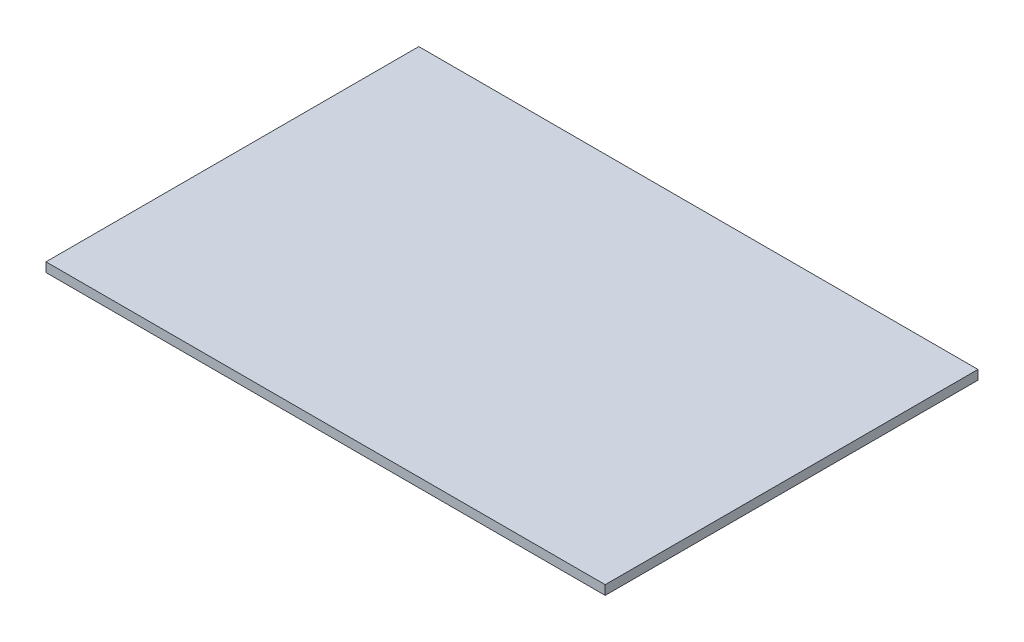
ISO-10303-21;
HEADER;
FILE_DESCRIPTION(('STEP AP214'),'2;1');
FILE_NAME('part.step','',(''),(''),'','','');
FILE_SCHEMA(('AUTOMOTIVE_DESIGN { 1 0 10303 214 1 1 1 1 }'));
ENDSEC;
DATA;
#1=APPLICATION_CONTEXT('core data for automotive mechanical design processes');
#2=APPLICATION_PROTOCOL_DEFINITION('international standard','automotive_design',2000,#1);
#3=PRODUCT_CONTEXT('',#1,'mechanical');
#4=PRODUCT('Part','Part','',(#3));
#5=PRODUCT_RELATED_PRODUCT_CATEGORY('part','',(#4));
#6=PRODUCT_DEFINITION_FORMATION('','',#4);
#7=PRODUCT_DEFINITION_CONTEXT('part definition',#1,'design');
#8=PRODUCT_DEFINITION('design','',#6,#7);
#9=PRODUCT_DEFINITION_SHAPE('','',#8);
#10=(LENGTH_UNIT() NAMED_UNIT(*) SI_UNIT(.MILLI.,.METRE.));
#11=(NAMED_UNIT(*) PLANE_ANGLE_UNIT() SI_UNIT($,.RADIAN.));
#12=(NAMED_UNIT(*) SI_UNIT($,.STERADIAN.) SOLID_ANGLE_UNIT());
#13=UNCERTAINTY_MEASURE_WITH_UNIT(LENGTH_MEASURE(1.E-05),#10,'distance_accuracy_value','');
#14=(GEOMETRIC_REPRESENTATION_CONTEXT(3) GLOBAL_UNCERTAINTY_ASSIGNED_CONTEXT((#13)) GLOBAL_UNIT_ASSIGNED_CONTEXT((#10,
#11,#12)) REPRESENTATION_CONTEXT('',''));
#15=CARTESIAN_POINT('',(0.,0.,0.));
#16=DIRECTION('',(0.,0.,1.));
#17=DIRECTION('',(1.,0.,0.));
#18=AXIS2_PLACEMENT_3D('',#15,#16,#17);
#19=CARTESIAN_POINT('',(300.,-10.,200.));
#20=DIRECTION('',(1.,0.,0.));
#21=DIRECTION('',(0.,0.,-1.));
#22=AXIS2_PLACEMENT_3D('',#19,#20,#21);
#23=PLANE('',#22);
#24=DIRECTION('',(0.,0.,-1.));
#25=VECTOR('',#24,1.);
#26=CARTESIAN_POINT('',(300.,0.,200.));
#27=LINE('',#26,#25);
#28=CARTESIAN_POINT('',(300.,0.,200.));
#29=VERTEX_POINT('',#28);
#30=CARTESIAN_POINT('',(300.,0.,-200.));
#31=VERTEX_POINT('',#30);
#32=EDGE_CURVE('E112',#29,#31,#27,.T.);
#33=ORIENTED_EDGE('',*,*,#32,.F.);
#34=DIRECTION('',(0.,1.,0.));
#35=VECTOR('',#34,1.);
#36=CARTESIAN_POINT('',(300.,-10.,200.));
#37=LINE('',#36,#35);
#38=CARTESIAN_POINT('',(300.,-10.,200.));
#39=VERTEX_POINT('',#38);
#40=EDGE_CURVE('E12',#39,#29,#37,.T.);
#41=ORIENTED_EDGE('',*,*,#40,.F.);
#42=DIRECTION('',(0.,0.,-1.));
#43=VECTOR('',#42,1.);
#44=CARTESIAN_POINT('',(300.,-10.,200.));
#45=LINE('',#44,#43);
#46=CARTESIAN_POINT('',(300.,-10.,-200.));
#47=VERTEX_POINT('',#46);
#48=EDGE_CURVE('E107',#39,#47,#45,.T.);
#49=ORIENTED_EDGE('',*,*,#48,.T.);
#50=DIRECTION('',(0.,1.,0.));
#51=VECTOR('',#50,1.);
#52=CARTESIAN_POINT('',(300.,-10.,-200.));
#53=LINE('',#52,#51);
#54=EDGE_CURVE('E50',#47,#31,#53,.T.);
#55=ORIENTED_EDGE('',*,*,#54,.T.);
#56=EDGE_LOOP('',(#33,#41,#49,#55));
#57=FACE_BOUND('',#56,.T.);
#58=ADVANCED_FACE('F47',(#57),#23,.T.);
#59=CARTESIAN_POINT('',(300.,-10.,200.));
#60=DIRECTION('',(0.,0.,-1.));
#61=DIRECTION('',(-1.,0.,0.));
#62=AXIS2_PLACEMENT_3D('',#59,#60,#61);
#63=PLANE('',#62);
#64=DIRECTION('',(-1.,0.,0.));
#65=VECTOR('',#64,1.);
#66=CARTESIAN_POINT('',(300.,0.,200.));
#67=LINE('',#66,#65);
#68=CARTESIAN_POINT('',(-300.,0.,200.));
#69=VERTEX_POINT('',#68);
#70=EDGE_CURVE('E80',#29,#69,#67,.T.);
#71=ORIENTED_EDGE('',*,*,#70,.T.);
#72=DIRECTION('',(0.,1.,0.));
#73=VECTOR('',#72,1.);
#74=CARTESIAN_POINT('',(-300.,-10.,200.));
#75=LINE('',#74,#73);
#76=CARTESIAN_POINT('',(-300.,-10.,200.));
#77=VERTEX_POINT('',#76);
#78=EDGE_CURVE('E56',#77,#69,#75,.T.);
#79=ORIENTED_EDGE('',*,*,#78,.F.);
#80=DIRECTION('',(-1.,0.,0.));
#81=VECTOR('',#80,1.);
#82=CARTESIAN_POINT('',(300.,-10.,200.));
#83=LINE('',#82,#81);
#84=EDGE_CURVE('E97',#39,#77,#83,.T.);
#85=ORIENTED_EDGE('',*,*,#84,.F.);
#86=ORIENTED_EDGE('',*,*,#40,.T.);
#87=EDGE_LOOP('',(#71,#79,#85,#86));
#88=FACE_BOUND('',#87,.T.);
#89=ADVANCED_FACE('F122',(#88),#63,.F.);
#90=CARTESIAN_POINT('',(-300.,-10.,200.));
#91=DIRECTION('',(1.,0.,0.));
#92=DIRECTION('',(0.,0.,-1.));
#93=AXIS2_PLACEMENT_3D('',#90,#91,#92);
#94=PLANE('',#93);
#95=DIRECTION('',(0.,0.,-1.));
#96=VECTOR('',#95,1.);
#97=CARTESIAN_POINT('',(-300.,0.,200.));
#98=LINE('',#97,#96);
#99=CARTESIAN_POINT('',(-300.,0.,-200.));
#100=VERTEX_POINT('',#99);
#101=EDGE_CURVE('E104',#69,#100,#98,.T.);
#102=ORIENTED_EDGE('',*,*,#101,.T.);
#103=DIRECTION('',(0.,1.,0.));
#104=VECTOR('',#103,1.);
#105=CARTESIAN_POINT('',(-300.,-10.,-200.));
#106=LINE('',#105,#104);
#107=CARTESIAN_POINT('',(-300.,-10.,-200.));
#108=VERTEX_POINT('',#107);
#109=EDGE_CURVE('E101',#108,#100,#106,.T.);
#110=ORIENTED_EDGE('',*,*,#109,.F.);
#111=DIRECTION('',(0.,0.,-1.));
#112=VECTOR('',#111,1.);
#113=CARTESIAN_POINT('',(-300.,-10.,200.));
#114=LINE('',#113,#112);
#115=EDGE_CURVE('E92',#77,#108,#114,.T.);
#116=ORIENTED_EDGE('',*,*,#115,.F.);
#117=ORIENTED_EDGE('',*,*,#78,.T.);
#118=EDGE_LOOP('',(#102,#110,#116,#117));
#119=FACE_BOUND('',#118,.T.);
#120=ADVANCED_FACE('F102',(#119),#94,.F.);
#121=CARTESIAN_POINT('',(300.,-10.,-200.));
#122=DIRECTION('',(0.,0.,-1.));
#123=DIRECTION('',(-1.,0.,0.));
#124=AXIS2_PLACEMENT_3D('',#121,#122,#123);
#125=PLANE('',#124);
#126=DIRECTION('',(-1.,0.,0.));
#127=VECTOR('',#126,1.);
#128=CARTESIAN_POINT('',(300.,0.,-200.));
#129=LINE('',#128,#127);
#130=EDGE_CURVE('E115',#31,#100,#129,.T.);
#131=ORIENTED_EDGE('',*,*,#130,.F.);
#132=ORIENTED_EDGE('',*,*,#54,.F.);
#133=DIRECTION('',(-1.,0.,0.));
#134=VECTOR('',#133,1.);
#135=CARTESIAN_POINT('',(300.,-10.,-200.));
#136=LINE('',#135,#134);
#137=EDGE_CURVE('E96',#47,#108,#136,.T.);
#138=ORIENTED_EDGE('',*,*,#137,.T.);
#139=ORIENTED_EDGE('',*,*,#109,.T.);
#140=EDGE_LOOP('',(#131,#132,#138,#139));
#141=FACE_BOUND('',#140,.T.);
#142=ADVANCED_FACE('F106',(#141),#125,.T.);
#143=CARTESIAN_POINT('',(0.,-10.,0.));
#144=DIRECTION('',(0.,1.,0.));
#145=DIRECTION('',(0.,0.,1.));
#146=AXIS2_PLACEMENT_3D('',#143,#144,#145);
#147=PLANE('',#146);
#148=ORIENTED_EDGE('',*,*,#48,.F.);
#149=ORIENTED_EDGE('',*,*,#84,.T.);
#150=ORIENTED_EDGE('',*,*,#115,.T.);
#151=ORIENTED_EDGE('',*,*,#137,.F.);
#152=EDGE_LOOP('',(#148,#149,#150,#151));
#153=FACE_BOUND('',#152,.T.);
#154=ADVANCED_FACE('F95',(#153),#147,.F.);
#155=CARTESIAN_POINT('',(0.,0.,0.));
#156=DIRECTION('',(0.,1.,0.));
#157=DIRECTION('',(0.,0.,1.));
#158=AXIS2_PLACEMENT_3D('',#155,#156,#157);
#159=PLANE('',#158);
#160=ORIENTED_EDGE('',*,*,#32,.T.);
#161=ORIENTED_EDGE('',*,*,#130,.T.);
#162=ORIENTED_EDGE('',*,*,#101,.F.);
#163=ORIENTED_EDGE('',*,*,#70,.F.);
#164=EDGE_LOOP('',(#160,#161,#162,#163));
#165=FACE_BOUND('',#164,.T.);
#166=ADVANCED_FACE('F120',(#165),#159,.T.);
#167=CLOSED_SHELL('',(#58,#89,#120,#142,#154,#166));
#168=MANIFOLD_SOLID_BREP('B2',#167);
#169=CARTESIAN_POINT('',(300.,-10.,200.));
#170=DIRECTION('',(1.,0.,0.));
#171=DIRECTION('',(0.,0.,-1.));
#172=AXIS2_PLACEMENT_3D('',#169,#170,#171);
#173=PLANE('',#172);
#174=DIRECTION('',(0.,0.,-1.));
#175=VECTOR('',#174,1.);
#176=CARTESIAN_POINT('',(300.,0.,200.));
#177=LINE('',#176,#175);
#178=CARTESIAN_POINT('',(300.,0.,200.));
#179=VERTEX_POINT('',#178);
#180=CARTESIAN_POINT('',(300.,0.,-200.));
#181=VERTEX_POINT('',#180);
#182=EDGE_CURVE('E249',#179,#181,#177,.T.);
#183=ORIENTED_EDGE('',*,*,#182,.F.);
#184=DIRECTION('',(0.,1.,0.));
#185=VECTOR('',#184,1.);
#186=CARTESIAN_POINT('',(300.,-10.,200.));
#187=LINE('',#186,#185);
#188=CARTESIAN_POINT('',(300.,-10.,200.));
#189=VERTEX_POINT('',#188);
#190=EDGE_CURVE('E45',#189,#179,#187,.T.);
#191=ORIENTED_EDGE('',*,*,#190,.F.);
#192=DIRECTION('',(0.,0.,-1.));
#193=VECTOR('',#192,1.);
#194=CARTESIAN_POINT('',(300.,-10.,200.));
#195=LINE('',#194,#193);
#196=CARTESIAN_POINT('',(300.,-10.,-200.));
#197=VERTEX_POINT('',#196);
#198=EDGE_CURVE('E244',#189,#197,#195,.T.);
#199=ORIENTED_EDGE('',*,*,#198,.T.);
#200=DIRECTION('',(0.,1.,0.));
#201=VECTOR('',#200,1.);
#202=CARTESIAN_POINT('',(300.,-10.,-200.));
#203=LINE('',#202,#201);
#204=EDGE_CURVE('E187',#197,#181,#203,.T.);
#205=ORIENTED_EDGE('',*,*,#204,.T.);
#206=EDGE_LOOP('',(#183,#191,#199,#205));
#207=FACE_BOUND('',#206,.T.);
#208=ADVANCED_FACE('F184',(#207),#173,.T.);
#209=CARTESIAN_POINT('',(300.,-10.,200.));
#210=DIRECTION('',(0.,0.,-1.));
#211=DIRECTION('',(-1.,0.,0.));
#212=AXIS2_PLACEMENT_3D('',#209,#210,#211);
#213=PLANE('',#212);
#214=DIRECTION('',(-1.,0.,0.));
#215=VECTOR('',#214,1.);
#216=CARTESIAN_POINT('',(300.,0.,200.));
#217=LINE('',#216,#215);
#218=CARTESIAN_POINT('',(-300.,0.,200.));
#219=VERTEX_POINT('',#218);
#220=EDGE_CURVE('E217',#179,#219,#217,.T.);
#221=ORIENTED_EDGE('',*,*,#220,.T.);
#222=DIRECTION('',(0.,1.,0.));
#223=VECTOR('',#222,1.);
#224=CARTESIAN_POINT('',(-300.,-10.,200.));
#225=LINE('',#224,#223);
#226=CARTESIAN_POINT('',(-300.,-10.,200.));
#227=VERTEX_POINT('',#226);
#228=EDGE_CURVE('E193',#227,#219,#225,.T.);
#229=ORIENTED_EDGE('',*,*,#228,.F.);
#230=DIRECTION('',(-1.,0.,0.));
#231=VECTOR('',#230,1.);
#232=CARTESIAN_POINT('',(300.,-10.,200.));
#233=LINE('',#232,#231);
#234=EDGE_CURVE('E234',#189,#227,#233,.T.);
#235=ORIENTED_EDGE('',*,*,#234,.F.);
#236=ORIENTED_EDGE('',*,*,#190,.T.);
#237=EDGE_LOOP('',(#221,#229,#235,#236));
#238=FACE_BOUND('',#237,.T.);
#239=ADVANCED_FACE('F259',(#238),#213,.F.);
#240=CARTESIAN_POINT('',(-300.,-10.,200.));
#241=DIRECTION('',(1.,0.,0.));
#242=DIRECTION('',(0.,0.,-1.));
#243=AXIS2_PLACEMENT_3D('',#240,#241,#242);
#244=PLANE('',#243);
#245=DIRECTION('',(0.,0.,-1.));
#246=VECTOR('',#245,1.);
#247=CARTESIAN_POINT('',(-300.,0.,200.));
#248=LINE('',#247,#246);
#249=CARTESIAN_POINT('',(-300.,0.,-200.));
#250=VERTEX_POINT('',#249);
#251=EDGE_CURVE('E241',#219,#250,#248,.T.);
#252=ORIENTED_EDGE('',*,*,#251,.T.);
#253=DIRECTION('',(0.,1.,0.));
#254=VECTOR('',#253,1.);
#255=CARTESIAN_POINT('',(-300.,-10.,-200.));
#256=LINE('',#255,#254);
#257=CARTESIAN_POINT('',(-300.,-10.,-200.));
#258=VERTEX_POINT('',#257);
#259=EDGE_CURVE('E238',#258,#250,#256,.T.);
#260=ORIENTED_EDGE('',*,*,#259,.F.);
#261=DIRECTION('',(0.,0.,-1.));
#262=VECTOR('',#261,1.);
#263=CARTESIAN_POINT('',(-300.,-10.,200.));
#264=LINE('',#263,#262);
#265=EDGE_CURVE('E229',#227,#258,#264,.T.);
#266=ORIENTED_EDGE('',*,*,#265,.F.);
#267=ORIENTED_EDGE('',*,*,#228,.T.);
#268=EDGE_LOOP('',(#252,#260,#266,#267));
#269=FACE_BOUND('',#268,.T.);
#270=ADVANCED_FACE('F239',(#269),#244,.F.);
#271=CARTESIAN_POINT('',(300.,-10.,-200.));
#272=DIRECTION('',(0.,0.,-1.));
#273=DIRECTION('',(-1.,0.,0.));
#274=AXIS2_PLACEMENT_3D('',#271,#272,#273);
#275=PLANE('',#274);
#276=DIRECTION('',(-1.,0.,0.));
#277=VECTOR('',#276,1.);
#278=CARTESIAN_POINT('',(300.,0.,-200.));
#279=LINE('',#278,#277);
#280=EDGE_CURVE('E252',#181,#250,#279,.T.);
#281=ORIENTED_EDGE('',*,*,#280,.F.);
#282=ORIENTED_EDGE('',*,*,#204,.F.);
#283=DIRECTION('',(-1.,0.,0.));
#284=VECTOR('',#283,1.);
#285=CARTESIAN_POINT('',(300.,-10.,-200.));
#286=LINE('',#285,#284);
#287=EDGE_CURVE('E233',#197,#258,#286,.T.);
#288=ORIENTED_EDGE('',*,*,#287,.T.);
#289=ORIENTED_EDGE('',*,*,#259,.T.);
#290=EDGE_LOOP('',(#281,#282,#288,#289));
#291=FACE_BOUND('',#290,.T.);
#292=ADVANCED_FACE('F243',(#291),#275,.T.);
#293=CARTESIAN_POINT('',(0.,-10.,0.));
#294=DIRECTION('',(0.,1.,0.));
#295=DIRECTION('',(0.,0.,1.));
#296=AXIS2_PLACEMENT_3D('',#293,#294,#295);
#297=PLANE('',#296);
#298=ORIENTED_EDGE('',*,*,#198,.F.);
#299=ORIENTED_EDGE('',*,*,#234,.T.);
#300=ORIENTED_EDGE('',*,*,#265,.T.);
#301=ORIENTED_EDGE('',*,*,#287,.F.);
#302=EDGE_LOOP('',(#298,#299,#300,#301));
#303=FACE_BOUND('',#302,.T.);
#304=ADVANCED_FACE('F232',(#303),#297,.F.);
#305=CARTESIAN_POINT('',(0.,0.,0.));
#306=DIRECTION('',(0.,1.,0.));
#307=DIRECTION('',(0.,0.,1.));
#308=AXIS2_PLACEMENT_3D('',#305,#306,#307);
#309=PLANE('',#308);
#310=ORIENTED_EDGE('',*,*,#182,.T.);
#311=ORIENTED_EDGE('',*,*,#280,.T.);
#312=ORIENTED_EDGE('',*,*,#251,.F.);
#313=ORIENTED_EDGE('',*,*,#220,.F.);
#314=EDGE_LOOP('',(#310,#311,#312,#313));
#315=FACE_BOUND('',#314,.T.);
#316=ADVANCED_FACE('F257',(#315),#309,.T.);
#317=CLOSED_SHELL('',(#208,#239,#270,#292,#304,#316));
#318=MANIFOLD_SOLID_BREP('B6',#317);
#319=ADVANCED_BREP_SHAPE_REPRESENTATION('',(#18,#168,#318),#14);
#320=SHAPE_DEFINITION_REPRESENTATION(#9,#319);
ENDSEC;
END-ISO-10303-21;
